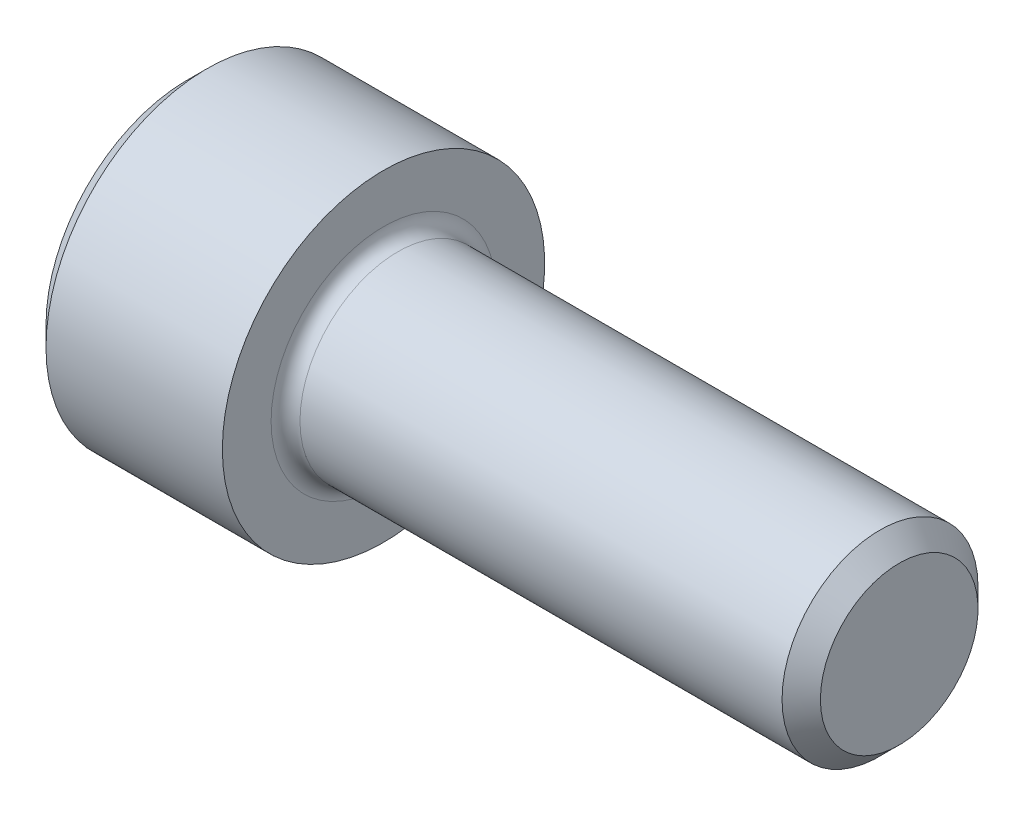
ISO-10303-21;
HEADER;
FILE_DESCRIPTION(('STEP AP214'),'2;1');
FILE_NAME('part.step','',(''),(''),'','','');
FILE_SCHEMA(('AUTOMOTIVE_DESIGN { 1 0 10303 214 1 1 1 1 }'));
ENDSEC;
DATA;
#1=APPLICATION_CONTEXT('core data for automotive mechanical design processes');
#2=APPLICATION_PROTOCOL_DEFINITION('international standard','automotive_design',2000,#1);
#3=PRODUCT_CONTEXT('',#1,'mechanical');
#4=PRODUCT('Part','Part','',(#3));
#5=PRODUCT_RELATED_PRODUCT_CATEGORY('part','',(#4));
#6=PRODUCT_DEFINITION_FORMATION('','',#4);
#7=PRODUCT_DEFINITION_CONTEXT('part definition',#1,'design');
#8=PRODUCT_DEFINITION('design','',#6,#7);
#9=PRODUCT_DEFINITION_SHAPE('','',#8);
#10=(LENGTH_UNIT() NAMED_UNIT(*) SI_UNIT(.MILLI.,.METRE.));
#11=(NAMED_UNIT(*) PLANE_ANGLE_UNIT() SI_UNIT($,.RADIAN.));
#12=(NAMED_UNIT(*) SI_UNIT($,.STERADIAN.) SOLID_ANGLE_UNIT());
#13=UNCERTAINTY_MEASURE_WITH_UNIT(LENGTH_MEASURE(1.E-05),#10,'distance_accuracy_value','');
#14=(GEOMETRIC_REPRESENTATION_CONTEXT(3) GLOBAL_UNCERTAINTY_ASSIGNED_CONTEXT((#13)) GLOBAL_UNIT_ASSIGNED_CONTEXT((#10,
#11,#12)) REPRESENTATION_CONTEXT('',''));
#15=CARTESIAN_POINT('',(0.,0.,0.));
#16=DIRECTION('',(0.,0.,1.));
#17=DIRECTION('',(1.,0.,0.));
#18=AXIS2_PLACEMENT_3D('',#15,#16,#17);
#19=CARTESIAN_POINT('',(0.,0.,0.));
#20=DIRECTION('',(-1.,0.,0.));
#21=DIRECTION('',(0.,0.,1.));
#22=AXIS2_PLACEMENT_3D('',#19,#20,#21);
#23=PLANE('',#22);
#24=DIRECTION('',(0.,-0.499999999999998,0.866025403784439));
#25=VECTOR('',#24,1.);
#26=CARTESIAN_POINT('',(0.,2.2920921156882,0.));
#27=LINE('',#26,#25);
#28=CARTESIAN_POINT('',(0.,2.2920921156882,0.));
#29=VERTEX_POINT('',#28);
#30=CARTESIAN_POINT('',(0.,1.1460460578441,1.98501));
#31=VERTEX_POINT('',#30);
#32=EDGE_CURVE('E264',#29,#31,#27,.T.);
#33=ORIENTED_EDGE('',*,*,#32,.T.);
#34=DIRECTION('',(0.,1.,0.));
#35=VECTOR('',#34,1.);
#36=CARTESIAN_POINT('',(0.,-1.14604605784409,1.98501));
#37=LINE('',#36,#35);
#38=CARTESIAN_POINT('',(0.,-1.14604605784409,1.98501));
#39=VERTEX_POINT('',#38);
#40=EDGE_CURVE('E135',#39,#31,#37,.T.);
#41=ORIENTED_EDGE('',*,*,#40,.F.);
#42=DIRECTION('',(0.,-0.500000000000001,-0.866025403784438));
#43=VECTOR('',#42,1.);
#44=CARTESIAN_POINT('',(0.,-1.14604605784409,1.98501));
#45=LINE('',#44,#43);
#46=CARTESIAN_POINT('',(0.,-2.29209211568819,0.));
#47=VERTEX_POINT('',#46);
#48=EDGE_CURVE('E267',#39,#47,#45,.T.);
#49=ORIENTED_EDGE('',*,*,#48,.T.);
#50=DIRECTION('',(0.,0.499999999999998,-0.86602540378444));
#51=VECTOR('',#50,1.);
#52=CARTESIAN_POINT('',(0.,-2.29209211568819,0.));
#53=LINE('',#52,#51);
#54=CARTESIAN_POINT('',(0.,-1.1460460578441,-1.98501));
#55=VERTEX_POINT('',#54);
#56=EDGE_CURVE('E270',#47,#55,#53,.T.);
#57=ORIENTED_EDGE('',*,*,#56,.T.);
#58=DIRECTION('',(0.,-1.,0.));
#59=VECTOR('',#58,1.);
#60=CARTESIAN_POINT('',(0.,1.1460460578441,-1.98501));
#61=LINE('',#60,#59);
#62=CARTESIAN_POINT('',(0.,1.1460460578441,-1.98501));
#63=VERTEX_POINT('',#62);
#64=EDGE_CURVE('E273',#63,#55,#61,.T.);
#65=ORIENTED_EDGE('',*,*,#64,.F.);
#66=DIRECTION('',(0.,-0.500000000000001,-0.866025403784438));
#67=VECTOR('',#66,1.);
#68=CARTESIAN_POINT('',(0.,2.2920921156882,0.));
#69=LINE('',#68,#67);
#70=EDGE_CURVE('E130',#29,#63,#69,.T.);
#71=ORIENTED_EDGE('',*,*,#70,.F.);
#72=EDGE_LOOP('',(#33,#41,#49,#57,#65,#71));
#73=FACE_BOUND('',#72,.T.);
#74=CARTESIAN_POINT('',(0.,0.,0.));
#75=DIRECTION('',(-1.,0.,0.));
#76=DIRECTION('',(0.,0.,1.));
#77=AXIS2_PLACEMENT_3D('',#74,#75,#76);
#78=CIRCLE('',#77,3.48615);
#79=CARTESIAN_POINT('',(0.,0.,3.48615));
#80=VERTEX_POINT('',#79);
#81=EDGE_CURVE('E159',#80,#80,#78,.T.);
#82=ORIENTED_EDGE('',*,*,#81,.T.);
#83=EDGE_LOOP('',(#82));
#84=FACE_BOUND('',#83,.T.);
#85=ADVANCED_FACE('F39',(#73,#84),#23,.T.);
#86=CARTESIAN_POINT('',(0.,0.,0.));
#87=DIRECTION('',(1.,0.,0.));
#88=DIRECTION('',(0.,0.,-1.));
#89=AXIS2_PLACEMENT_3D('',#86,#87,#88);
#90=CONICAL_SURFACE('',#89,3.48615,0.785398163397449);
#91=CARTESIAN_POINT('',(0.4826,0.,0.));
#92=DIRECTION('',(-1.,0.,0.));
#93=DIRECTION('',(0.,0.,1.));
#94=AXIS2_PLACEMENT_3D('',#91,#92,#93);
#95=CIRCLE('',#94,3.96875);
#96=CARTESIAN_POINT('',(0.4826,0.,3.96875));
#97=VERTEX_POINT('',#96);
#98=EDGE_CURVE('E156',#97,#97,#95,.T.);
#99=ORIENTED_EDGE('',*,*,#98,.T.);
#100=EDGE_LOOP('',(#99));
#101=FACE_BOUND('',#100,.T.);
#102=ORIENTED_EDGE('',*,*,#81,.F.);
#103=EDGE_LOOP('',(#102));
#104=FACE_BOUND('',#103,.T.);
#105=ADVANCED_FACE('F181',(#101,#104),#90,.T.);
#106=CARTESIAN_POINT('',(-31.75,0.,0.));
#107=DIRECTION('',(-1.,0.,0.));
#108=DIRECTION('',(0.,0.,1.));
#109=AXIS2_PLACEMENT_3D('',#106,#107,#108);
#110=CYLINDRICAL_SURFACE('',#109,3.96875);
#111=CARTESIAN_POINT('',(4.826,0.,0.));
#112=DIRECTION('',(-1.,0.,0.));
#113=DIRECTION('',(0.,0.,1.));
#114=AXIS2_PLACEMENT_3D('',#111,#112,#113);
#115=CIRCLE('',#114,3.96875);
#116=CARTESIAN_POINT('',(4.826,0.,3.96875));
#117=VERTEX_POINT('',#116);
#118=EDGE_CURVE('E153',#117,#117,#115,.T.);
#119=ORIENTED_EDGE('',*,*,#118,.T.);
#120=EDGE_LOOP('',(#119));
#121=FACE_BOUND('',#120,.T.);
#122=ORIENTED_EDGE('',*,*,#98,.F.);
#123=EDGE_LOOP('',(#122));
#124=FACE_BOUND('',#123,.T.);
#125=ADVANCED_FACE('F186',(#121,#124),#110,.T.);
#126=CARTESIAN_POINT('',(4.826,3.96875,0.));
#127=DIRECTION('',(1.,0.,0.));
#128=DIRECTION('',(0.,0.,-1.));
#129=AXIS2_PLACEMENT_3D('',#126,#127,#128);
#130=PLANE('',#129);
#131=CARTESIAN_POINT('',(4.826,0.,0.));
#132=DIRECTION('',(1.,0.,0.));
#133=DIRECTION('',(0.,0.,-1.));
#134=AXIS2_PLACEMENT_3D('',#131,#132,#133);
#135=CIRCLE('',#134,2.76860000000002);
#136=CARTESIAN_POINT('',(4.826,0.,-2.76860000000002));
#137=VERTEX_POINT('',#136);
#138=EDGE_CURVE('E47',#137,#137,#135,.F.);
#139=ORIENTED_EDGE('',*,*,#138,.T.);
#140=EDGE_LOOP('',(#139));
#141=FACE_BOUND('',#140,.T.);
#142=ORIENTED_EDGE('',*,*,#118,.F.);
#143=EDGE_LOOP('',(#142));
#144=FACE_BOUND('',#143,.T.);
#145=ADVANCED_FACE('F164',(#141,#144),#130,.T.);
#146=CARTESIAN_POINT('',(-31.75,0.,0.));
#147=DIRECTION('',(-1.,0.,0.));
#148=DIRECTION('',(0.,0.,1.));
#149=AXIS2_PLACEMENT_3D('',#146,#147,#148);
#150=CYLINDRICAL_SURFACE('',#149,2.41300000000002);
#151=CARTESIAN_POINT('',(5.1816,0.,0.));
#152=DIRECTION('',(1.,0.,0.));
#153=DIRECTION('',(0.,0.,-1.));
#154=AXIS2_PLACEMENT_3D('',#151,#152,#153);
#155=CIRCLE('',#154,2.41300000000002);
#156=CARTESIAN_POINT('',(5.1816,0.,-2.41300000000002));
#157=VERTEX_POINT('',#156);
#158=EDGE_CURVE('E11',#157,#157,#155,.T.);
#159=ORIENTED_EDGE('',*,*,#158,.T.);
#160=EDGE_LOOP('',(#159));
#161=FACE_BOUND('',#160,.T.);
#162=CARTESIAN_POINT('',(17.0535600000001,0.,0.));
#163=DIRECTION('',(-1.,0.,0.));
#164=DIRECTION('',(0.,0.,1.));
#165=AXIS2_PLACEMENT_3D('',#162,#163,#164);
#166=CIRCLE('',#165,2.41300000000003);
#167=CARTESIAN_POINT('',(17.0535600000001,0.,2.41300000000003));
#168=VERTEX_POINT('',#167);
#169=EDGE_CURVE('E150',#168,#168,#166,.T.);
#170=ORIENTED_EDGE('',*,*,#169,.T.);
#171=EDGE_LOOP('',(#170));
#172=FACE_BOUND('',#171,.T.);
#173=ADVANCED_FACE('F196',(#161,#172),#150,.T.);
#174=CARTESIAN_POINT('',(17.526,0.,0.));
#175=DIRECTION('',(-1.,0.,0.));
#176=DIRECTION('',(0.,0.,1.));
#177=AXIS2_PLACEMENT_3D('',#174,#175,#176);
#178=CONICAL_SURFACE('',#177,1.94056,0.785398163397538);
#179=ORIENTED_EDGE('',*,*,#169,.F.);
#180=EDGE_LOOP('',(#179));
#181=FACE_BOUND('',#180,.T.);
#182=CARTESIAN_POINT('',(17.526,0.,0.));
#183=DIRECTION('',(-1.,0.,0.));
#184=DIRECTION('',(0.,0.,1.));
#185=AXIS2_PLACEMENT_3D('',#182,#183,#184);
#186=CIRCLE('',#185,1.94056);
#187=CARTESIAN_POINT('',(17.526,0.,1.94056));
#188=VERTEX_POINT('',#187);
#189=EDGE_CURVE('E146',#188,#188,#186,.T.);
#190=ORIENTED_EDGE('',*,*,#189,.T.);
#191=EDGE_LOOP('',(#190));
#192=FACE_BOUND('',#191,.T.);
#193=ADVANCED_FACE('F177',(#181,#192),#178,.T.);
#194=CARTESIAN_POINT('',(17.526,1.94056,0.));
#195=DIRECTION('',(1.,0.,0.));
#196=DIRECTION('',(0.,0.,-1.));
#197=AXIS2_PLACEMENT_3D('',#194,#195,#196);
#198=PLANE('',#197);
#199=ORIENTED_EDGE('',*,*,#189,.F.);
#200=EDGE_LOOP('',(#199));
#201=FACE_BOUND('',#200,.T.);
#202=ADVANCED_FACE('F168',(#201),#198,.T.);
#203=CARTESIAN_POINT('',(5.1816,0.,0.));
#204=DIRECTION('',(1.,0.,0.));
#205=DIRECTION('',(0.,0.,-1.));
#206=AXIS2_PLACEMENT_3D('',#203,#204,#205);
#207=TOROIDAL_SURFACE('',#206,2.76860000000002,0.3556);
#208=ORIENTED_EDGE('',*,*,#158,.F.);
#209=EDGE_LOOP('',(#208));
#210=FACE_BOUND('',#209,.T.);
#211=ORIENTED_EDGE('',*,*,#138,.F.);
#212=EDGE_LOOP('',(#211));
#213=FACE_BOUND('',#212,.T.);
#214=ADVANCED_FACE('F41',(#210,#213),#207,.F.);
#215=CARTESIAN_POINT('',(2.286,2.2920921156882,0.));
#216=DIRECTION('',(0.,-0.866025403784439,-0.499999999999998));
#217=DIRECTION('',(0.,0.499999999999998,-0.86602540378444));
#218=AXIS2_PLACEMENT_3D('',#215,#216,#217);
#219=PLANE('',#218);
#220=ORIENTED_EDGE('',*,*,#32,.F.);
#221=DIRECTION('',(-1.,0.,0.));
#222=VECTOR('',#221,1.);
#223=CARTESIAN_POINT('',(2.286,2.2920921156882,0.));
#224=LINE('',#223,#222);
#225=CARTESIAN_POINT('',(2.286,2.2920921156882,0.));
#226=VERTEX_POINT('',#225);
#227=EDGE_CURVE('E254',#226,#29,#224,.T.);
#228=ORIENTED_EDGE('',*,*,#227,.F.);
#229=DIRECTION('',(0.,-0.499999999999998,0.866025403784439));
#230=VECTOR('',#229,1.);
#231=CARTESIAN_POINT('',(2.286,2.2920921156882,0.));
#232=LINE('',#231,#230);
#233=CARTESIAN_POINT('',(2.286,1.71906908676615,0.992504999999997));
#234=VERTEX_POINT('',#233);
#235=EDGE_CURVE('E122',#226,#234,#232,.T.);
#236=ORIENTED_EDGE('',*,*,#235,.T.);
#237=CARTESIAN_POINT('',(2.286,1.1460460578441,1.98501));
#238=VERTEX_POINT('',#237);
#239=EDGE_CURVE('E113',#234,#238,#232,.T.);
#240=ORIENTED_EDGE('',*,*,#239,.T.);
#241=DIRECTION('',(-1.,0.,0.));
#242=VECTOR('',#241,1.);
#243=CARTESIAN_POINT('',(2.286,1.1460460578441,1.98501));
#244=LINE('',#243,#242);
#245=EDGE_CURVE('E127',#238,#31,#244,.T.);
#246=ORIENTED_EDGE('',*,*,#245,.T.);
#247=EDGE_LOOP('',(#220,#228,#236,#240,#246));
#248=FACE_BOUND('',#247,.T.);
#249=ADVANCED_FACE('F126',(#248),#219,.T.);
#250=CARTESIAN_POINT('',(2.286,-1.14604605784409,1.98501));
#251=DIRECTION('',(0.,0.,1.));
#252=DIRECTION('',(0.,-1.,0.));
#253=AXIS2_PLACEMENT_3D('',#250,#251,#252);
#254=PLANE('',#253);
#255=ORIENTED_EDGE('',*,*,#40,.T.);
#256=ORIENTED_EDGE('',*,*,#245,.F.);
#257=DIRECTION('',(0.,1.,0.));
#258=VECTOR('',#257,1.);
#259=CARTESIAN_POINT('',(2.286,-1.14604605784409,1.98501));
#260=LINE('',#259,#258);
#261=CARTESIAN_POINT('',(2.286,0.,1.98501));
#262=VERTEX_POINT('',#261);
#263=EDGE_CURVE('E110',#262,#238,#260,.T.);
#264=ORIENTED_EDGE('',*,*,#263,.F.);
#265=CARTESIAN_POINT('',(2.286,-1.14604605784409,1.98501));
#266=VERTEX_POINT('',#265);
#267=EDGE_CURVE('E121',#266,#262,#260,.T.);
#268=ORIENTED_EDGE('',*,*,#267,.F.);
#269=DIRECTION('',(-1.,0.,0.));
#270=VECTOR('',#269,1.);
#271=CARTESIAN_POINT('',(2.286,-1.14604605784409,1.98501));
#272=LINE('',#271,#270);
#273=EDGE_CURVE('E137',#266,#39,#272,.T.);
#274=ORIENTED_EDGE('',*,*,#273,.T.);
#275=EDGE_LOOP('',(#255,#256,#264,#268,#274));
#276=FACE_BOUND('',#275,.T.);
#277=ADVANCED_FACE('F132',(#276),#254,.F.);
#278=CARTESIAN_POINT('',(2.286,-1.14604605784409,1.98501));
#279=DIRECTION('',(0.,0.866025403784438,-0.500000000000001));
#280=DIRECTION('',(0.,0.500000000000001,0.866025403784438));
#281=AXIS2_PLACEMENT_3D('',#278,#279,#280);
#282=PLANE('',#281);
#283=ORIENTED_EDGE('',*,*,#48,.F.);
#284=ORIENTED_EDGE('',*,*,#273,.F.);
#285=DIRECTION('',(0.,-0.500000000000001,-0.866025403784438));
#286=VECTOR('',#285,1.);
#287=CARTESIAN_POINT('',(2.286,-1.14604605784409,1.98501));
#288=LINE('',#287,#286);
#289=CARTESIAN_POINT('',(2.286,-1.71906908676614,0.992505));
#290=VERTEX_POINT('',#289);
#291=EDGE_CURVE('E293',#266,#290,#288,.T.);
#292=ORIENTED_EDGE('',*,*,#291,.T.);
#293=CARTESIAN_POINT('',(2.286,-2.29209211568819,0.));
#294=VERTEX_POINT('',#293);
#295=EDGE_CURVE('E282',#290,#294,#288,.T.);
#296=ORIENTED_EDGE('',*,*,#295,.T.);
#297=DIRECTION('',(-1.,0.,0.));
#298=VECTOR('',#297,1.);
#299=CARTESIAN_POINT('',(2.286,-2.29209211568819,0.));
#300=LINE('',#299,#298);
#301=EDGE_CURVE('E142',#294,#47,#300,.T.);
#302=ORIENTED_EDGE('',*,*,#301,.T.);
#303=EDGE_LOOP('',(#283,#284,#292,#296,#302));
#304=FACE_BOUND('',#303,.T.);
#305=ADVANCED_FACE('F208',(#304),#282,.T.);
#306=CARTESIAN_POINT('',(2.286,-2.29209211568819,0.));
#307=DIRECTION('',(0.,0.86602540378444,0.499999999999998));
#308=DIRECTION('',(0.,-0.499999999999998,0.86602540378444));
#309=AXIS2_PLACEMENT_3D('',#306,#307,#308);
#310=PLANE('',#309);
#311=ORIENTED_EDGE('',*,*,#56,.F.);
#312=ORIENTED_EDGE('',*,*,#301,.F.);
#313=DIRECTION('',(0.,0.499999999999998,-0.86602540378444));
#314=VECTOR('',#313,1.);
#315=CARTESIAN_POINT('',(2.286,-2.29209211568819,0.));
#316=LINE('',#315,#314);
#317=CARTESIAN_POINT('',(2.286,-1.71906908676615,-0.992504999999995));
#318=VERTEX_POINT('',#317);
#319=EDGE_CURVE('E260',#294,#318,#316,.T.);
#320=ORIENTED_EDGE('',*,*,#319,.T.);
#321=CARTESIAN_POINT('',(2.286,-1.1460460578441,-1.98501));
#322=VERTEX_POINT('',#321);
#323=EDGE_CURVE('E292',#318,#322,#316,.T.);
#324=ORIENTED_EDGE('',*,*,#323,.T.);
#325=DIRECTION('',(-1.,0.,0.));
#326=VECTOR('',#325,1.);
#327=CARTESIAN_POINT('',(2.286,-1.1460460578441,-1.98501));
#328=LINE('',#327,#326);
#329=EDGE_CURVE('E253',#322,#55,#328,.T.);
#330=ORIENTED_EDGE('',*,*,#329,.T.);
#331=EDGE_LOOP('',(#311,#312,#320,#324,#330));
#332=FACE_BOUND('',#331,.T.);
#333=ADVANCED_FACE('F211',(#332),#310,.T.);
#334=CARTESIAN_POINT('',(2.286,1.1460460578441,-1.98501));
#335=DIRECTION('',(0.,0.,-1.));
#336=DIRECTION('',(0.,1.,0.));
#337=AXIS2_PLACEMENT_3D('',#334,#335,#336);
#338=PLANE('',#337);
#339=ORIENTED_EDGE('',*,*,#64,.T.);
#340=ORIENTED_EDGE('',*,*,#329,.F.);
#341=DIRECTION('',(0.,-1.,0.));
#342=VECTOR('',#341,1.);
#343=CARTESIAN_POINT('',(2.286,1.1460460578441,-1.98501));
#344=LINE('',#343,#342);
#345=CARTESIAN_POINT('',(2.286,0.,-1.98501));
#346=VERTEX_POINT('',#345);
#347=EDGE_CURVE('E257',#346,#322,#344,.T.);
#348=ORIENTED_EDGE('',*,*,#347,.F.);
#349=CARTESIAN_POINT('',(2.286,1.1460460578441,-1.98501));
#350=VERTEX_POINT('',#349);
#351=EDGE_CURVE('E54',#350,#346,#344,.T.);
#352=ORIENTED_EDGE('',*,*,#351,.F.);
#353=DIRECTION('',(-1.,0.,0.));
#354=VECTOR('',#353,1.);
#355=CARTESIAN_POINT('',(2.286,1.1460460578441,-1.98501));
#356=LINE('',#355,#354);
#357=EDGE_CURVE('E250',#350,#63,#356,.T.);
#358=ORIENTED_EDGE('',*,*,#357,.T.);
#359=EDGE_LOOP('',(#339,#340,#348,#352,#358));
#360=FACE_BOUND('',#359,.T.);
#361=ADVANCED_FACE('F215',(#360),#338,.F.);
#362=CARTESIAN_POINT('',(2.286,2.2920921156882,0.));
#363=DIRECTION('',(0.,0.866025403784438,-0.500000000000001));
#364=DIRECTION('',(0.,0.500000000000001,0.866025403784438));
#365=AXIS2_PLACEMENT_3D('',#362,#363,#364);
#366=PLANE('',#365);
#367=ORIENTED_EDGE('',*,*,#70,.T.);
#368=ORIENTED_EDGE('',*,*,#357,.F.);
#369=DIRECTION('',(0.,-0.500000000000001,-0.866025403784438));
#370=VECTOR('',#369,1.);
#371=CARTESIAN_POINT('',(2.286,2.2920921156882,0.));
#372=LINE('',#371,#370);
#373=CARTESIAN_POINT('',(2.286,1.71906908676615,-0.992505000000003));
#374=VERTEX_POINT('',#373);
#375=EDGE_CURVE('E240',#374,#350,#372,.T.);
#376=ORIENTED_EDGE('',*,*,#375,.F.);
#377=EDGE_CURVE('E246',#226,#374,#372,.T.);
#378=ORIENTED_EDGE('',*,*,#377,.F.);
#379=ORIENTED_EDGE('',*,*,#227,.T.);
#380=EDGE_LOOP('',(#367,#368,#376,#378,#379));
#381=FACE_BOUND('',#380,.T.);
#382=ADVANCED_FACE('F219',(#381),#366,.F.);
#383=CARTESIAN_POINT('',(2.286,3.43813817353229,-1.98501));
#384=DIRECTION('',(1.,0.,0.));
#385=DIRECTION('',(0.,0.,-1.));
#386=AXIS2_PLACEMENT_3D('',#383,#384,#385);
#387=PLANE('',#386);
#388=ORIENTED_EDGE('',*,*,#347,.T.);
#389=ORIENTED_EDGE('',*,*,#323,.F.);
#390=CARTESIAN_POINT('',(2.286,0.,0.));
#391=DIRECTION('',(-1.,0.,0.));
#392=DIRECTION('',(0.,0.,1.));
#393=AXIS2_PLACEMENT_3D('',#390,#391,#392);
#394=CIRCLE('',#393,1.98501);
#395=EDGE_CURVE('E288',#346,#318,#394,.T.);
#396=ORIENTED_EDGE('',*,*,#395,.F.);
#397=EDGE_LOOP('',(#388,#389,#396));
#398=FACE_BOUND('',#397,.T.);
#399=ADVANCED_FACE('F223',(#398),#387,.F.);
#400=ORIENTED_EDGE('',*,*,#319,.F.);
#401=ORIENTED_EDGE('',*,*,#295,.F.);
#402=EDGE_CURVE('E140',#318,#290,#394,.T.);
#403=ORIENTED_EDGE('',*,*,#402,.F.);
#404=EDGE_LOOP('',(#400,#401,#403));
#405=FACE_BOUND('',#404,.T.);
#406=ADVANCED_FACE('F226',(#405),#387,.F.);
#407=ORIENTED_EDGE('',*,*,#291,.F.);
#408=ORIENTED_EDGE('',*,*,#267,.T.);
#409=EDGE_CURVE('E136',#290,#262,#394,.T.);
#410=ORIENTED_EDGE('',*,*,#409,.F.);
#411=EDGE_LOOP('',(#407,#408,#410));
#412=FACE_BOUND('',#411,.T.);
#413=ADVANCED_FACE('F231',(#412),#387,.F.);
#414=ORIENTED_EDGE('',*,*,#263,.T.);
#415=ORIENTED_EDGE('',*,*,#239,.F.);
#416=EDGE_CURVE('E116',#262,#234,#394,.T.);
#417=ORIENTED_EDGE('',*,*,#416,.F.);
#418=EDGE_LOOP('',(#414,#415,#417));
#419=FACE_BOUND('',#418,.T.);
#420=ADVANCED_FACE('F112',(#419),#387,.F.);
#421=ORIENTED_EDGE('',*,*,#235,.F.);
#422=ORIENTED_EDGE('',*,*,#377,.T.);
#423=EDGE_CURVE('E147',#234,#374,#394,.T.);
#424=ORIENTED_EDGE('',*,*,#423,.F.);
#425=EDGE_LOOP('',(#421,#422,#424));
#426=FACE_BOUND('',#425,.T.);
#427=ADVANCED_FACE('F234',(#426),#387,.F.);
#428=ORIENTED_EDGE('',*,*,#375,.T.);
#429=ORIENTED_EDGE('',*,*,#351,.T.);
#430=EDGE_CURVE('E243',#374,#346,#394,.T.);
#431=ORIENTED_EDGE('',*,*,#430,.F.);
#432=EDGE_LOOP('',(#428,#429,#431));
#433=FACE_BOUND('',#432,.T.);
#434=ADVANCED_FACE('F204',(#433),#387,.F.);
#435=CARTESIAN_POINT('',(2.286,0.,0.));
#436=DIRECTION('',(-1.,0.,0.));
#437=DIRECTION('',(0.,0.,1.));
#438=AXIS2_PLACEMENT_3D('',#435,#436,#437);
#439=CONICAL_SURFACE('',#438,1.98501,1.04719755119659);
#440=CARTESIAN_POINT('',(3.43204605784411,0.,0.));
#441=VERTEX_POINT('',#440);
#442=VERTEX_LOOP('',#441);
#443=FACE_BOUND('',#442,.T.);
#444=ORIENTED_EDGE('',*,*,#416,.T.);
#445=ORIENTED_EDGE('',*,*,#423,.T.);
#446=ORIENTED_EDGE('',*,*,#430,.T.);
#447=ORIENTED_EDGE('',*,*,#395,.T.);
#448=ORIENTED_EDGE('',*,*,#402,.T.);
#449=ORIENTED_EDGE('',*,*,#409,.T.);
#450=EDGE_LOOP('',(#444,#445,#446,#447,#448,#449));
#451=FACE_BOUND('',#450,.T.);
#452=ADVANCED_FACE('F202',(#443,#451),#439,.F.);
#453=CLOSED_SHELL('',(#85,#105,#125,#145,#173,#193,#202,#214,#249,#277,#305,#333,#361,#382,#399,
#406,#413,#420,#427,#434,#452));
#454=MANIFOLD_SOLID_BREP('B2',#453);
#455=ADVANCED_BREP_SHAPE_REPRESENTATION('',(#18,#454),#14);
#456=SHAPE_DEFINITION_REPRESENTATION(#9,#455);
ENDSEC;
END-ISO-10303-21;
